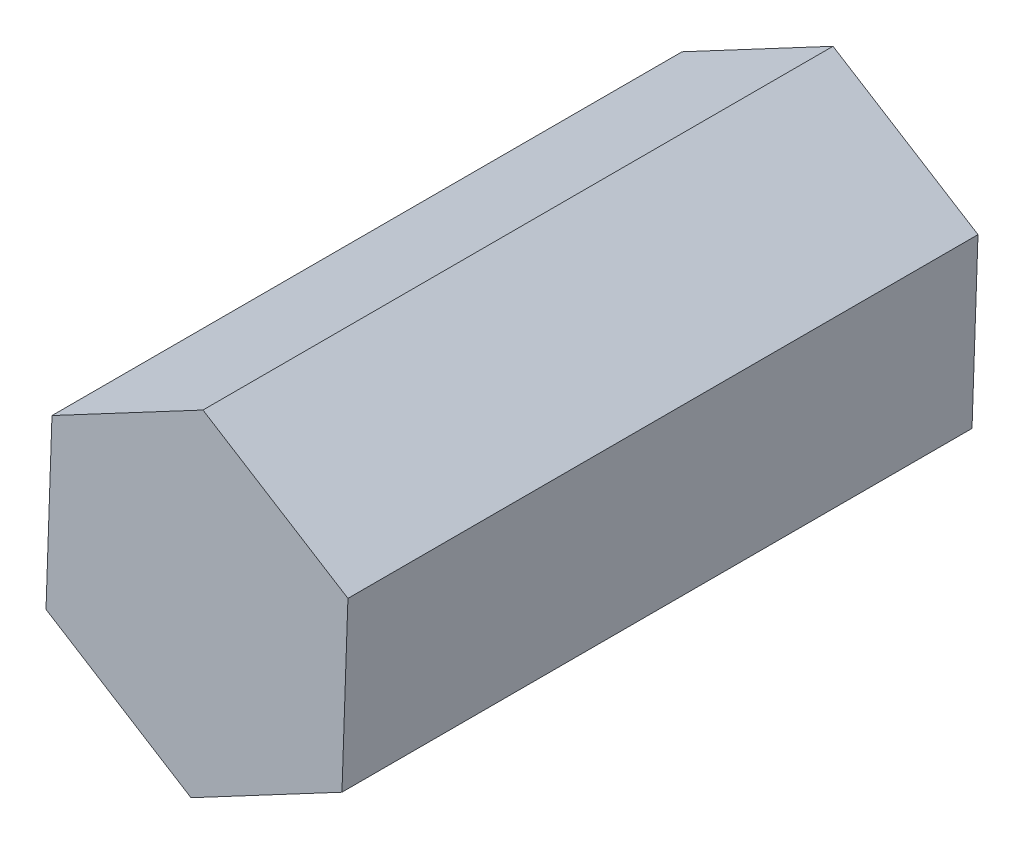
ISO-10303-21;
HEADER;
FILE_DESCRIPTION(('STEP AP214'),'2;1');
FILE_NAME('part.step','',(''),(''),'','','');
FILE_SCHEMA(('AUTOMOTIVE_DESIGN { 1 0 10303 214 1 1 1 1 }'));
ENDSEC;
DATA;
#1=APPLICATION_CONTEXT('core data for automotive mechanical design processes');
#2=APPLICATION_PROTOCOL_DEFINITION('international standard','automotive_design',2000,#1);
#3=PRODUCT_CONTEXT('',#1,'mechanical');
#4=PRODUCT('Part','Part','',(#3));
#5=PRODUCT_RELATED_PRODUCT_CATEGORY('part','',(#4));
#6=PRODUCT_DEFINITION_FORMATION('','',#4);
#7=PRODUCT_DEFINITION_CONTEXT('part definition',#1,'design');
#8=PRODUCT_DEFINITION('design','',#6,#7);
#9=PRODUCT_DEFINITION_SHAPE('','',#8);
#10=(LENGTH_UNIT() NAMED_UNIT(*) SI_UNIT(.MILLI.,.METRE.));
#11=(NAMED_UNIT(*) PLANE_ANGLE_UNIT() SI_UNIT($,.RADIAN.));
#12=(NAMED_UNIT(*) SI_UNIT($,.STERADIAN.) SOLID_ANGLE_UNIT());
#13=UNCERTAINTY_MEASURE_WITH_UNIT(LENGTH_MEASURE(1.E-05),#10,'distance_accuracy_value','');
#14=(GEOMETRIC_REPRESENTATION_CONTEXT(3) GLOBAL_UNCERTAINTY_ASSIGNED_CONTEXT((#13)) GLOBAL_UNIT_ASSIGNED_CONTEXT((#10,
#11,#12)) REPRESENTATION_CONTEXT('',''));
#15=CARTESIAN_POINT('',(0.,0.,0.));
#16=DIRECTION('',(0.,0.,1.));
#17=DIRECTION('',(1.,0.,0.));
#18=AXIS2_PLACEMENT_3D('',#15,#16,#17);
#19=CARTESIAN_POINT('',(0.,0.,0.));
#20=DIRECTION('',(0.,0.,1.));
#21=DIRECTION('',(1.,0.,0.));
#22=AXIS2_PLACEMENT_3D('',#19,#20,#21);
#23=PLANE('',#22);
#24=DIRECTION('',(0.882991698024118,0.469388603632944,0.));
#25=VECTOR('',#24,1.);
#26=CARTESIAN_POINT('',(-0.0949561936466874,-2.71188433651244,0.));
#27=LINE('',#26,#25);
#28=CARTESIAN_POINT('',(-0.0949561936466874,-2.71188433651244,0.));
#29=VERTEX_POINT('',#28);
#30=CARTESIAN_POINT('',(2.30108263072154,-1.43817664420093,0.));
#31=VERTEX_POINT('',#30);
#32=EDGE_CURVE('E118',#29,#31,#27,.T.);
#33=ORIENTED_EDGE('',*,*,#32,.F.);
#34=DIRECTION('',(0.847998304005092,-0.529998940003173,0.));
#35=VECTOR('',#34,1.);
#36=CARTESIAN_POINT('',(-2.39603882436822,-1.27370769231151,0.));
#37=LINE('',#36,#35);
#38=CARTESIAN_POINT('',(-2.39603882436822,-1.27370769231151,0.));
#39=VERTEX_POINT('',#38);
#40=EDGE_CURVE('E79',#39,#29,#37,.T.);
#41=ORIENTED_EDGE('',*,*,#40,.F.);
#42=DIRECTION('',(-0.0349933940190248,-0.999387543636116,0.));
#43=VECTOR('',#42,1.);
#44=CARTESIAN_POINT('',(-2.30108263072153,1.43817664420094,0.));
#45=LINE('',#44,#43);
#46=CARTESIAN_POINT('',(-2.30108263072153,1.43817664420094,0.));
#47=VERTEX_POINT('',#46);
#48=EDGE_CURVE('E73',#47,#39,#45,.T.);
#49=ORIENTED_EDGE('',*,*,#48,.F.);
#50=DIRECTION('',(-0.882991698024118,-0.469388603632943,0.));
#51=VECTOR('',#50,1.);
#52=CARTESIAN_POINT('',(0.0949561936466926,2.71188433651244,0.));
#53=LINE('',#52,#51);
#54=CARTESIAN_POINT('',(0.0949561936466926,2.71188433651244,0.));
#55=VERTEX_POINT('',#54);
#56=EDGE_CURVE('E108',#55,#47,#53,.T.);
#57=ORIENTED_EDGE('',*,*,#56,.F.);
#58=DIRECTION('',(-0.847998304005093,0.529998940003172,0.));
#59=VECTOR('',#58,1.);
#60=CARTESIAN_POINT('',(2.39603882436823,1.27370769231151,0.));
#61=LINE('',#60,#59);
#62=CARTESIAN_POINT('',(2.39603882436823,1.27370769231151,0.));
#63=VERTEX_POINT('',#62);
#64=EDGE_CURVE('E124',#63,#55,#61,.T.);
#65=ORIENTED_EDGE('',*,*,#64,.F.);
#66=DIRECTION('',(0.0349933940190248,0.999387543636116,0.));
#67=VECTOR('',#66,1.);
#68=CARTESIAN_POINT('',(2.30108263072154,-1.43817664420093,0.));
#69=LINE('',#68,#67);
#70=EDGE_CURVE('E121',#31,#63,#69,.T.);
#71=ORIENTED_EDGE('',*,*,#70,.F.);
#72=EDGE_LOOP('',(#33,#41,#49,#57,#65,#71));
#73=FACE_BOUND('',#72,.T.);
#74=CARTESIAN_POINT('',(0.,0.,0.));
#75=DIRECTION('',(0.,0.,1.));
#76=DIRECTION('',(1.,0.,0.));
#77=AXIS2_PLACEMENT_3D('',#74,#75,#76);
#78=CIRCLE('',#77,1.25);
#79=CARTESIAN_POINT('',(1.25,0.,0.));
#80=VERTEX_POINT('',#79);
#81=EDGE_CURVE('E169',#80,#80,#78,.T.);
#82=ORIENTED_EDGE('',*,*,#81,.T.);
#83=EDGE_LOOP('',(#82));
#84=FACE_BOUND('',#83,.T.);
#85=ADVANCED_FACE('F33',(#73,#84),#23,.F.);
#86=CARTESIAN_POINT('',(-0.0949561936466874,-2.71188433651244,10.));
#87=DIRECTION('',(-0.469388603632944,0.882991698024118,0.));
#88=DIRECTION('',(-0.882991698024118,-0.469388603632944,0.));
#89=AXIS2_PLACEMENT_3D('',#86,#87,#88);
#90=PLANE('',#89);
#91=ORIENTED_EDGE('',*,*,#32,.T.);
#92=DIRECTION('',(0.,0.,-1.));
#93=VECTOR('',#92,1.);
#94=CARTESIAN_POINT('',(2.30108263072154,-1.43817664420093,10.));
#95=LINE('',#94,#93);
#96=CARTESIAN_POINT('',(2.30108263072154,-1.43817664420093,10.));
#97=VERTEX_POINT('',#96);
#98=EDGE_CURVE('E11',#97,#31,#95,.T.);
#99=ORIENTED_EDGE('',*,*,#98,.F.);
#100=DIRECTION('',(0.882991698024118,0.469388603632944,0.));
#101=VECTOR('',#100,1.);
#102=CARTESIAN_POINT('',(-0.0949561936466874,-2.71188433651244,10.));
#103=LINE('',#102,#101);
#104=CARTESIAN_POINT('',(-0.0949561936466874,-2.71188433651244,10.));
#105=VERTEX_POINT('',#104);
#106=EDGE_CURVE('E129',#105,#97,#103,.T.);
#107=ORIENTED_EDGE('',*,*,#106,.F.);
#108=DIRECTION('',(0.,0.,-1.));
#109=VECTOR('',#108,1.);
#110=CARTESIAN_POINT('',(-0.0949561936466874,-2.71188433651244,10.));
#111=LINE('',#110,#109);
#112=EDGE_CURVE('E114',#105,#29,#111,.T.);
#113=ORIENTED_EDGE('',*,*,#112,.T.);
#114=EDGE_LOOP('',(#91,#99,#107,#113));
#115=FACE_BOUND('',#114,.T.);
#116=ADVANCED_FACE('F35',(#115),#90,.F.);
#117=CARTESIAN_POINT('',(2.30108263072154,-1.43817664420093,10.));
#118=DIRECTION('',(-0.999387543636116,0.0349933940190248,0.));
#119=DIRECTION('',(-0.0349933940190248,-0.999387543636116,0.));
#120=AXIS2_PLACEMENT_3D('',#117,#118,#119);
#121=PLANE('',#120);
#122=ORIENTED_EDGE('',*,*,#70,.T.);
#123=DIRECTION('',(0.,0.,-1.));
#124=VECTOR('',#123,1.);
#125=CARTESIAN_POINT('',(2.39603882436823,1.27370769231151,10.));
#126=LINE('',#125,#124);
#127=CARTESIAN_POINT('',(2.39603882436823,1.27370769231151,10.));
#128=VERTEX_POINT('',#127);
#129=EDGE_CURVE('E42',#128,#63,#126,.T.);
#130=ORIENTED_EDGE('',*,*,#129,.F.);
#131=DIRECTION('',(0.0349933940190248,0.999387543636116,0.));
#132=VECTOR('',#131,1.);
#133=CARTESIAN_POINT('',(2.30108263072154,-1.43817664420093,10.));
#134=LINE('',#133,#132);
#135=EDGE_CURVE('E87',#97,#128,#134,.T.);
#136=ORIENTED_EDGE('',*,*,#135,.F.);
#137=ORIENTED_EDGE('',*,*,#98,.T.);
#138=EDGE_LOOP('',(#122,#130,#136,#137));
#139=FACE_BOUND('',#138,.T.);
#140=ADVANCED_FACE('F157',(#139),#121,.F.);
#141=CARTESIAN_POINT('',(2.39603882436823,1.27370769231151,10.));
#142=DIRECTION('',(-0.529998940003172,-0.847998304005093,0.));
#143=DIRECTION('',(0.847998304005093,-0.529998940003172,0.));
#144=AXIS2_PLACEMENT_3D('',#141,#142,#143);
#145=PLANE('',#144);
#146=ORIENTED_EDGE('',*,*,#64,.T.);
#147=DIRECTION('',(0.,0.,-1.));
#148=VECTOR('',#147,1.);
#149=CARTESIAN_POINT('',(0.0949561936466926,2.71188433651244,10.));
#150=LINE('',#149,#148);
#151=CARTESIAN_POINT('',(0.0949561936466926,2.71188433651244,10.));
#152=VERTEX_POINT('',#151);
#153=EDGE_CURVE('E109',#152,#55,#150,.T.);
#154=ORIENTED_EDGE('',*,*,#153,.F.);
#155=DIRECTION('',(-0.847998304005093,0.529998940003172,0.));
#156=VECTOR('',#155,1.);
#157=CARTESIAN_POINT('',(2.39603882436823,1.27370769231151,10.));
#158=LINE('',#157,#156);
#159=EDGE_CURVE('E100',#128,#152,#158,.T.);
#160=ORIENTED_EDGE('',*,*,#159,.F.);
#161=ORIENTED_EDGE('',*,*,#129,.T.);
#162=EDGE_LOOP('',(#146,#154,#160,#161));
#163=FACE_BOUND('',#162,.T.);
#164=ADVANCED_FACE('F135',(#163),#145,.F.);
#165=CARTESIAN_POINT('',(0.0949561936466926,2.71188433651244,10.));
#166=DIRECTION('',(0.469388603632943,-0.882991698024118,0.));
#167=DIRECTION('',(0.882991698024118,0.469388603632943,0.));
#168=AXIS2_PLACEMENT_3D('',#165,#166,#167);
#169=PLANE('',#168);
#170=ORIENTED_EDGE('',*,*,#56,.T.);
#171=DIRECTION('',(0.,0.,-1.));
#172=VECTOR('',#171,1.);
#173=CARTESIAN_POINT('',(-2.30108263072153,1.43817664420094,10.));
#174=LINE('',#173,#172);
#175=CARTESIAN_POINT('',(-2.30108263072153,1.43817664420094,10.));
#176=VERTEX_POINT('',#175);
#177=EDGE_CURVE('E105',#176,#47,#174,.T.);
#178=ORIENTED_EDGE('',*,*,#177,.F.);
#179=DIRECTION('',(-0.882991698024118,-0.469388603632943,0.));
#180=VECTOR('',#179,1.);
#181=CARTESIAN_POINT('',(0.0949561936466926,2.71188433651244,10.));
#182=LINE('',#181,#180);
#183=EDGE_CURVE('E94',#152,#176,#182,.T.);
#184=ORIENTED_EDGE('',*,*,#183,.F.);
#185=ORIENTED_EDGE('',*,*,#153,.T.);
#186=EDGE_LOOP('',(#170,#178,#184,#185));
#187=FACE_BOUND('',#186,.T.);
#188=ADVANCED_FACE('F106',(#187),#169,.F.);
#189=CARTESIAN_POINT('',(-2.30108263072153,1.43817664420094,10.));
#190=DIRECTION('',(0.999387543636116,-0.0349933940190248,0.));
#191=DIRECTION('',(0.0349933940190248,0.999387543636116,0.));
#192=AXIS2_PLACEMENT_3D('',#189,#190,#191);
#193=PLANE('',#192);
#194=ORIENTED_EDGE('',*,*,#48,.T.);
#195=DIRECTION('',(0.,0.,-1.));
#196=VECTOR('',#195,1.);
#197=CARTESIAN_POINT('',(-2.39603882436822,-1.27370769231151,10.));
#198=LINE('',#197,#196);
#199=CARTESIAN_POINT('',(-2.39603882436822,-1.27370769231151,10.));
#200=VERTEX_POINT('',#199);
#201=EDGE_CURVE('E110',#200,#39,#198,.T.);
#202=ORIENTED_EDGE('',*,*,#201,.F.);
#203=DIRECTION('',(-0.0349933940190248,-0.999387543636116,0.));
#204=VECTOR('',#203,1.);
#205=CARTESIAN_POINT('',(-2.30108263072153,1.43817664420094,10.));
#206=LINE('',#205,#204);
#207=EDGE_CURVE('E98',#176,#200,#206,.T.);
#208=ORIENTED_EDGE('',*,*,#207,.F.);
#209=ORIENTED_EDGE('',*,*,#177,.T.);
#210=EDGE_LOOP('',(#194,#202,#208,#209));
#211=FACE_BOUND('',#210,.T.);
#212=ADVANCED_FACE('F112',(#211),#193,.F.);
#213=CARTESIAN_POINT('',(-2.39603882436822,-1.27370769231151,10.));
#214=DIRECTION('',(0.529998940003173,0.847998304005092,0.));
#215=DIRECTION('',(-0.847998304005092,0.529998940003173,0.));
#216=AXIS2_PLACEMENT_3D('',#213,#214,#215);
#217=PLANE('',#216);
#218=ORIENTED_EDGE('',*,*,#40,.T.);
#219=ORIENTED_EDGE('',*,*,#112,.F.);
#220=DIRECTION('',(0.847998304005092,-0.529998940003173,0.));
#221=VECTOR('',#220,1.);
#222=CARTESIAN_POINT('',(-2.39603882436822,-1.27370769231151,10.));
#223=LINE('',#222,#221);
#224=EDGE_CURVE('E50',#200,#105,#223,.T.);
#225=ORIENTED_EDGE('',*,*,#224,.F.);
#226=ORIENTED_EDGE('',*,*,#201,.T.);
#227=EDGE_LOOP('',(#218,#219,#225,#226));
#228=FACE_BOUND('',#227,.T.);
#229=ADVANCED_FACE('F142',(#228),#217,.F.);
#230=CARTESIAN_POINT('',(0.,0.,10.));
#231=DIRECTION('',(0.,0.,1.));
#232=DIRECTION('',(1.,0.,0.));
#233=AXIS2_PLACEMENT_3D('',#230,#231,#232);
#234=PLANE('',#233);
#235=ORIENTED_EDGE('',*,*,#106,.T.);
#236=ORIENTED_EDGE('',*,*,#135,.T.);
#237=ORIENTED_EDGE('',*,*,#159,.T.);
#238=ORIENTED_EDGE('',*,*,#183,.T.);
#239=ORIENTED_EDGE('',*,*,#207,.T.);
#240=ORIENTED_EDGE('',*,*,#224,.T.);
#241=EDGE_LOOP('',(#235,#236,#237,#238,#239,#240));
#242=FACE_BOUND('',#241,.T.);
#243=ADVANCED_FACE('F96',(#242),#234,.T.);
#244=CARTESIAN_POINT('',(0.,0.,5.));
#245=DIRECTION('',(0.,0.,-1.));
#246=DIRECTION('',(-1.,0.,0.));
#247=AXIS2_PLACEMENT_3D('',#244,#245,#246);
#248=CYLINDRICAL_SURFACE('',#247,1.25);
#249=CARTESIAN_POINT('',(0.,0.,5.));
#250=DIRECTION('',(0.,0.,1.));
#251=DIRECTION('',(1.,0.,0.));
#252=AXIS2_PLACEMENT_3D('',#249,#250,#251);
#253=CIRCLE('',#252,1.25);
#254=CARTESIAN_POINT('',(1.25,0.,5.));
#255=VERTEX_POINT('',#254);
#256=EDGE_CURVE('E122',#255,#255,#253,.T.);
#257=ORIENTED_EDGE('',*,*,#256,.T.);
#258=EDGE_LOOP('',(#257));
#259=FACE_BOUND('',#258,.T.);
#260=ORIENTED_EDGE('',*,*,#81,.F.);
#261=EDGE_LOOP('',(#260));
#262=FACE_BOUND('',#261,.T.);
#263=ADVANCED_FACE('F149',(#259,#262),#248,.F.);
#264=CARTESIAN_POINT('',(0.,0.,5.));
#265=DIRECTION('',(0.,0.,1.));
#266=DIRECTION('',(1.,0.,0.));
#267=AXIS2_PLACEMENT_3D('',#264,#265,#266);
#268=PLANE('',#267);
#269=ORIENTED_EDGE('',*,*,#256,.F.);
#270=EDGE_LOOP('',(#269));
#271=FACE_BOUND('',#270,.T.);
#272=ADVANCED_FACE('F161',(#271),#268,.F.);
#273=CLOSED_SHELL('',(#85,#116,#140,#164,#188,#212,#229,#243,#263,#272));
#274=MANIFOLD_SOLID_BREP('B2',#273);
#275=ADVANCED_BREP_SHAPE_REPRESENTATION('',(#18,#274),#14);
#276=SHAPE_DEFINITION_REPRESENTATION(#9,#275);
ENDSEC;
END-ISO-10303-21;
